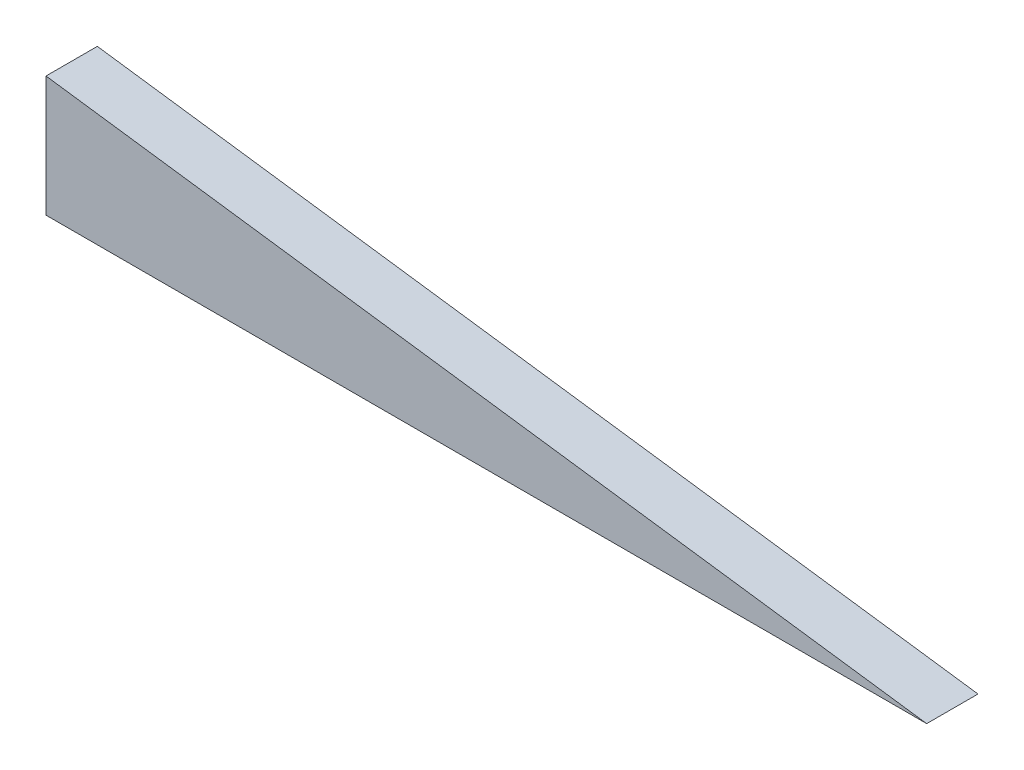
ISO-10303-21;
HEADER;
FILE_DESCRIPTION(('STEP AP214'),'2;1');
FILE_NAME('part.step','',(''),(''),'','','');
FILE_SCHEMA(('AUTOMOTIVE_DESIGN { 1 0 10303 214 1 1 1 1 }'));
ENDSEC;
DATA;
#1=APPLICATION_CONTEXT('core data for automotive mechanical design processes');
#2=APPLICATION_PROTOCOL_DEFINITION('international standard','automotive_design',2000,#1);
#3=PRODUCT_CONTEXT('',#1,'mechanical');
#4=PRODUCT('Part','Part','',(#3));
#5=PRODUCT_RELATED_PRODUCT_CATEGORY('part','',(#4));
#6=PRODUCT_DEFINITION_FORMATION('','',#4);
#7=PRODUCT_DEFINITION_CONTEXT('part definition',#1,'design');
#8=PRODUCT_DEFINITION('design','',#6,#7);
#9=PRODUCT_DEFINITION_SHAPE('','',#8);
#10=(LENGTH_UNIT() NAMED_UNIT(*) SI_UNIT(.MILLI.,.METRE.));
#11=(NAMED_UNIT(*) PLANE_ANGLE_UNIT() SI_UNIT($,.RADIAN.));
#12=(NAMED_UNIT(*) SI_UNIT($,.STERADIAN.) SOLID_ANGLE_UNIT());
#13=UNCERTAINTY_MEASURE_WITH_UNIT(LENGTH_MEASURE(1.E-05),#10,'distance_accuracy_value','');
#14=(GEOMETRIC_REPRESENTATION_CONTEXT(3) GLOBAL_UNCERTAINTY_ASSIGNED_CONTEXT((#13)) GLOBAL_UNIT_ASSIGNED_CONTEXT((#10,
#11,#12)) REPRESENTATION_CONTEXT('',''));
#15=CARTESIAN_POINT('',(0.,0.,0.));
#16=DIRECTION('',(0.,0.,1.));
#17=DIRECTION('',(1.,0.,0.));
#18=AXIS2_PLACEMENT_3D('',#15,#16,#17);
#19=CARTESIAN_POINT('',(-108.966,14.9147969479977,3.175));
#20=DIRECTION('',(-0.135611254096104,-0.990762124711316,0.));
#21=DIRECTION('',(0.990762124711316,-0.135611254096104,0.));
#22=AXIS2_PLACEMENT_3D('',#19,#20,#21);
#23=PLANE('',#22);
#24=DIRECTION('',(-0.990762124711316,0.135611254096104,0.));
#25=VECTOR('',#24,1.);
#26=CARTESIAN_POINT('',(-108.966,14.9147969479977,-3.175));
#27=LINE('',#26,#25);
#28=CARTESIAN_POINT('',(0.,0.,-3.175));
#29=VERTEX_POINT('',#28);
#30=CARTESIAN_POINT('',(-108.966,14.9147969479977,-3.175));
#31=VERTEX_POINT('',#30);
#32=EDGE_CURVE('E79',#29,#31,#27,.T.);
#33=ORIENTED_EDGE('',*,*,#32,.T.);
#34=DIRECTION('',(0.,0.,-1.));
#35=VECTOR('',#34,1.);
#36=CARTESIAN_POINT('',(-108.966,14.9147969479977,3.175));
#37=LINE('',#36,#35);
#38=CARTESIAN_POINT('',(-108.966,14.9147969479977,3.175));
#39=VERTEX_POINT('',#38);
#40=EDGE_CURVE('E11',#39,#31,#37,.T.);
#41=ORIENTED_EDGE('',*,*,#40,.F.);
#42=DIRECTION('',(-0.990762124711316,0.135611254096104,0.));
#43=VECTOR('',#42,1.);
#44=CARTESIAN_POINT('',(-108.966,14.9147969479977,3.175));
#45=LINE('',#44,#43);
#46=CARTESIAN_POINT('',(0.,0.,3.175));
#47=VERTEX_POINT('',#46);
#48=EDGE_CURVE('E72',#47,#39,#45,.T.);
#49=ORIENTED_EDGE('',*,*,#48,.F.);
#50=DIRECTION('',(0.,0.,-1.));
#51=VECTOR('',#50,1.);
#52=CARTESIAN_POINT('',(0.,0.,3.175));
#53=LINE('',#52,#51);
#54=EDGE_CURVE('E80',#47,#29,#53,.T.);
#55=ORIENTED_EDGE('',*,*,#54,.T.);
#56=EDGE_LOOP('',(#33,#41,#49,#55));
#57=FACE_BOUND('',#56,.T.);
#58=ADVANCED_FACE('F32',(#57),#23,.F.);
#59=CARTESIAN_POINT('',(-108.966,0.,3.175));
#60=DIRECTION('',(1.,0.,0.));
#61=DIRECTION('',(0.,0.,-1.));
#62=AXIS2_PLACEMENT_3D('',#59,#60,#61);
#63=PLANE('',#62);
#64=DIRECTION('',(0.,-1.,0.));
#65=VECTOR('',#64,1.);
#66=CARTESIAN_POINT('',(-108.966,0.,-3.175));
#67=LINE('',#66,#65);
#68=CARTESIAN_POINT('',(-108.966,0.,-3.175));
#69=VERTEX_POINT('',#68);
#70=EDGE_CURVE('E60',#31,#69,#67,.T.);
#71=ORIENTED_EDGE('',*,*,#70,.T.);
#72=DIRECTION('',(0.,0.,-1.));
#73=VECTOR('',#72,1.);
#74=CARTESIAN_POINT('',(-108.966,0.,3.175));
#75=LINE('',#74,#73);
#76=CARTESIAN_POINT('',(-108.966,0.,3.175));
#77=VERTEX_POINT('',#76);
#78=EDGE_CURVE('E40',#77,#69,#75,.T.);
#79=ORIENTED_EDGE('',*,*,#78,.F.);
#80=DIRECTION('',(0.,-1.,0.));
#81=VECTOR('',#80,1.);
#82=CARTESIAN_POINT('',(-108.966,0.,3.175));
#83=LINE('',#82,#81);
#84=EDGE_CURVE('E68',#39,#77,#83,.T.);
#85=ORIENTED_EDGE('',*,*,#84,.F.);
#86=ORIENTED_EDGE('',*,*,#40,.T.);
#87=EDGE_LOOP('',(#71,#79,#85,#86));
#88=FACE_BOUND('',#87,.T.);
#89=ADVANCED_FACE('F69',(#88),#63,.F.);
#90=CARTESIAN_POINT('',(0.,0.,3.175));
#91=DIRECTION('',(0.,1.,0.));
#92=DIRECTION('',(-1.,0.,0.));
#93=AXIS2_PLACEMENT_3D('',#90,#91,#92);
#94=PLANE('',#93);
#95=DIRECTION('',(1.,0.,0.));
#96=VECTOR('',#95,1.);
#97=CARTESIAN_POINT('',(0.,0.,-3.175));
#98=LINE('',#97,#96);
#99=EDGE_CURVE('E65',#69,#29,#98,.T.);
#100=ORIENTED_EDGE('',*,*,#99,.T.);
#101=ORIENTED_EDGE('',*,*,#54,.F.);
#102=DIRECTION('',(1.,0.,0.));
#103=VECTOR('',#102,1.);
#104=CARTESIAN_POINT('',(0.,0.,3.175));
#105=LINE('',#104,#103);
#106=EDGE_CURVE('E48',#77,#47,#105,.T.);
#107=ORIENTED_EDGE('',*,*,#106,.F.);
#108=ORIENTED_EDGE('',*,*,#78,.T.);
#109=EDGE_LOOP('',(#100,#101,#107,#108));
#110=FACE_BOUND('',#109,.T.);
#111=ADVANCED_FACE('F87',(#110),#94,.F.);
#112=CARTESIAN_POINT('',(-108.966,14.9147969479977,3.175));
#113=DIRECTION('',(0.,0.,1.));
#114=DIRECTION('',(1.,0.,0.));
#115=AXIS2_PLACEMENT_3D('',#112,#113,#114);
#116=PLANE('',#115);
#117=ORIENTED_EDGE('',*,*,#48,.T.);
#118=ORIENTED_EDGE('',*,*,#84,.T.);
#119=ORIENTED_EDGE('',*,*,#106,.T.);
#120=EDGE_LOOP('',(#117,#118,#119));
#121=FACE_BOUND('',#120,.T.);
#122=ADVANCED_FACE('F75',(#121),#116,.T.);
#123=CARTESIAN_POINT('',(-108.966,14.9147969479977,-3.175));
#124=DIRECTION('',(0.,0.,1.));
#125=DIRECTION('',(1.,0.,0.));
#126=AXIS2_PLACEMENT_3D('',#123,#124,#125);
#127=PLANE('',#126);
#128=ORIENTED_EDGE('',*,*,#32,.F.);
#129=ORIENTED_EDGE('',*,*,#99,.F.);
#130=ORIENTED_EDGE('',*,*,#70,.F.);
#131=EDGE_LOOP('',(#128,#129,#130));
#132=FACE_BOUND('',#131,.T.);
#133=ADVANCED_FACE('F88',(#132),#127,.F.);
#134=CLOSED_SHELL('',(#58,#89,#111,#122,#133));
#135=MANIFOLD_SOLID_BREP('B2',#134);
#136=ADVANCED_BREP_SHAPE_REPRESENTATION('',(#18,#135),#14);
#137=SHAPE_DEFINITION_REPRESENTATION(#9,#136);
ENDSEC;
END-ISO-10303-21;
